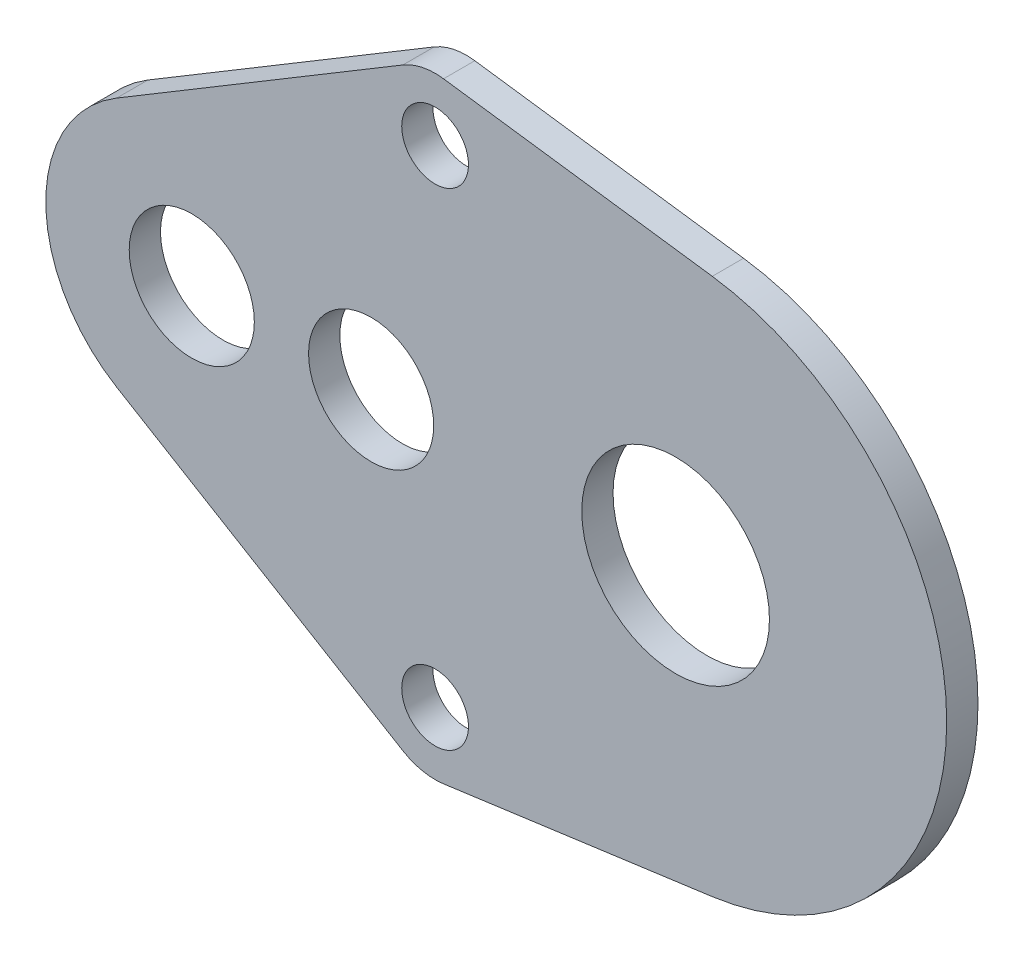
ISO-10303-21;
HEADER;
FILE_DESCRIPTION(('STEP AP214'),'2;1');
FILE_NAME('part.step','',(''),(''),'','','');
FILE_SCHEMA(('AUTOMOTIVE_DESIGN { 1 0 10303 214 1 1 1 1 }'));
ENDSEC;
DATA;
#1=APPLICATION_CONTEXT('core data for automotive mechanical design processes');
#2=APPLICATION_PROTOCOL_DEFINITION('international standard','automotive_design',2000,#1);
#3=PRODUCT_CONTEXT('',#1,'mechanical');
#4=PRODUCT('Part','Part','',(#3));
#5=PRODUCT_RELATED_PRODUCT_CATEGORY('part','',(#4));
#6=PRODUCT_DEFINITION_FORMATION('','',#4);
#7=PRODUCT_DEFINITION_CONTEXT('part definition',#1,'design');
#8=PRODUCT_DEFINITION('design','',#6,#7);
#9=PRODUCT_DEFINITION_SHAPE('','',#8);
#10=(LENGTH_UNIT() NAMED_UNIT(*) SI_UNIT(.MILLI.,.METRE.));
#11=(NAMED_UNIT(*) PLANE_ANGLE_UNIT() SI_UNIT($,.RADIAN.));
#12=(NAMED_UNIT(*) SI_UNIT($,.STERADIAN.) SOLID_ANGLE_UNIT());
#13=UNCERTAINTY_MEASURE_WITH_UNIT(LENGTH_MEASURE(1.E-05),#10,'distance_accuracy_value','');
#14=(GEOMETRIC_REPRESENTATION_CONTEXT(3) GLOBAL_UNCERTAINTY_ASSIGNED_CONTEXT((#13)) GLOBAL_UNIT_ASSIGNED_CONTEXT((#10,
#11,#12)) REPRESENTATION_CONTEXT('',''));
#15=CARTESIAN_POINT('',(0.,0.,0.));
#16=DIRECTION('',(0.,0.,1.));
#17=DIRECTION('',(1.,0.,0.));
#18=AXIS2_PLACEMENT_3D('',#15,#16,#17);
#19=CARTESIAN_POINT('',(11.667261889578,11.667261889578,1.6));
#20=DIRECTION('',(0.,0.,-1.));
#21=DIRECTION('',(-1.,0.,0.));
#22=AXIS2_PLACEMENT_3D('',#19,#20,#21);
#23=CYLINDRICAL_SURFACE('',#22,3.);
#24=DIRECTION('',(0.,0.,1.));
#25=VECTOR('',#24,1.);
#26=CARTESIAN_POINT('',(10.1234792899552,14.239563443654,-34.868952865985));
#27=LINE('',#26,#25);
#28=CARTESIAN_POINT('',(10.1234792899552,14.239563443654,1.6));
#29=VERTEX_POINT('',#28);
#30=CARTESIAN_POINT('',(10.1234792899552,14.239563443654,3.1));
#31=VERTEX_POINT('',#30);
#32=EDGE_CURVE('E55',#29,#31,#27,.T.);
#33=ORIENTED_EDGE('',*,*,#32,.T.);
#34=CARTESIAN_POINT('',(11.667261889578,11.667261889578,3.1));
#35=DIRECTION('',(0.,0.,1.));
#36=DIRECTION('',(1.,0.,0.));
#37=AXIS2_PLACEMENT_3D('',#34,#35,#36);
#38=CIRCLE('',#37,3.);
#39=CARTESIAN_POINT('',(12.0730700536144,14.6396884629355,3.1));
#40=VERTEX_POINT('',#39);
#41=EDGE_CURVE('E170',#40,#31,#38,.T.);
#42=ORIENTED_EDGE('',*,*,#41,.F.);
#43=DIRECTION('',(0.,0.,-1.));
#44=VECTOR('',#43,1.);
#45=CARTESIAN_POINT('',(12.0730700536144,14.6396884629355,1.6));
#46=LINE('',#45,#44);
#47=CARTESIAN_POINT('',(12.0730700536144,14.6396884629355,1.6));
#48=VERTEX_POINT('',#47);
#49=EDGE_CURVE('E181',#40,#48,#46,.T.);
#50=ORIENTED_EDGE('',*,*,#49,.T.);
#51=CARTESIAN_POINT('',(11.667261889578,11.667261889578,1.6));
#52=DIRECTION('',(0.,0.,1.));
#53=DIRECTION('',(1.,0.,0.));
#54=AXIS2_PLACEMENT_3D('',#51,#52,#53);
#55=CIRCLE('',#54,3.);
#56=EDGE_CURVE('E11',#48,#29,#55,.T.);
#57=ORIENTED_EDGE('',*,*,#56,.T.);
#58=EDGE_LOOP('',(#33,#42,#50,#57));
#59=FACE_BOUND('',#58,.T.);
#60=ADVANCED_FACE('F33',(#59),#23,.T.);
#61=CARTESIAN_POINT('',(11.667261889578,-11.667261889578,1.6));
#62=DIRECTION('',(0.,0.,-1.));
#63=DIRECTION('',(-1.,0.,0.));
#64=AXIS2_PLACEMENT_3D('',#61,#62,#63);
#65=CYLINDRICAL_SURFACE('',#64,3.);
#66=CARTESIAN_POINT('',(11.667261889578,-11.667261889578,3.1));
#67=DIRECTION('',(0.,0.,1.));
#68=DIRECTION('',(1.,0.,0.));
#69=AXIS2_PLACEMENT_3D('',#66,#67,#68);
#70=CIRCLE('',#69,3.);
#71=CARTESIAN_POINT('',(10.1234792899552,-14.239563443654,3.1));
#72=VERTEX_POINT('',#71);
#73=CARTESIAN_POINT('',(12.0730700536144,-14.6396884629355,3.1));
#74=VERTEX_POINT('',#73);
#75=EDGE_CURVE('E48',#72,#74,#70,.T.);
#76=ORIENTED_EDGE('',*,*,#75,.F.);
#77=DIRECTION('',(0.,0.,1.));
#78=VECTOR('',#77,1.);
#79=CARTESIAN_POINT('',(10.1234792899552,-14.239563443654,-34.868952865985));
#80=LINE('',#79,#78);
#81=CARTESIAN_POINT('',(10.1234792899552,-14.239563443654,1.6));
#82=VERTEX_POINT('',#81);
#83=EDGE_CURVE('E110',#82,#72,#80,.T.);
#84=ORIENTED_EDGE('',*,*,#83,.F.);
#85=CARTESIAN_POINT('',(11.667261889578,-11.667261889578,1.6));
#86=DIRECTION('',(0.,0.,1.));
#87=DIRECTION('',(1.,0.,0.));
#88=AXIS2_PLACEMENT_3D('',#85,#86,#87);
#89=CIRCLE('',#88,3.);
#90=CARTESIAN_POINT('',(12.0730700536144,-14.6396884629355,1.6));
#91=VERTEX_POINT('',#90);
#92=EDGE_CURVE('E169',#82,#91,#89,.T.);
#93=ORIENTED_EDGE('',*,*,#92,.T.);
#94=DIRECTION('',(0.,0.,-1.));
#95=VECTOR('',#94,1.);
#96=CARTESIAN_POINT('',(12.0730700536144,-14.6396884629355,1.6));
#97=LINE('',#96,#95);
#98=EDGE_CURVE('E36',#74,#91,#97,.T.);
#99=ORIENTED_EDGE('',*,*,#98,.F.);
#100=EDGE_LOOP('',(#76,#84,#93,#99));
#101=FACE_BOUND('',#100,.T.);
#102=ADVANCED_FACE('F198',(#101),#65,.T.);
#103=CARTESIAN_POINT('',(12.0730700536144,-14.6396884629355,1.6));
#104=DIRECTION('',(-0.135269388012114,0.990808857785813,0.));
#105=DIRECTION('',(-0.990808857785813,-0.135269388012114,0.));
#106=AXIS2_PLACEMENT_3D('',#103,#104,#105);
#107=PLANE('',#106);
#108=DIRECTION('',(-0.990808857785813,-0.135269388012114,0.));
#109=VECTOR('',#108,1.);
#110=CARTESIAN_POINT('',(12.0730700536144,-14.6396884629355,1.6));
#111=LINE('',#110,#109);
#112=CARTESIAN_POINT('',(24.9585020441575,-12.8805151512156,1.6));
#113=VERTEX_POINT('',#112);
#114=EDGE_CURVE('E131',#113,#91,#111,.T.);
#115=ORIENTED_EDGE('',*,*,#114,.F.);
#116=DIRECTION('',(0.,0.,-1.));
#117=VECTOR('',#116,1.);
#118=CARTESIAN_POINT('',(24.9585020441575,-12.8805151512156,1.6));
#119=LINE('',#118,#117);
#120=CARTESIAN_POINT('',(24.9585020441575,-12.8805151512156,3.1));
#121=VERTEX_POINT('',#120);
#122=EDGE_CURVE('E188',#121,#113,#119,.T.);
#123=ORIENTED_EDGE('',*,*,#122,.F.);
#124=DIRECTION('',(0.990808857785813,0.135269388012114,0.));
#125=VECTOR('',#124,1.);
#126=CARTESIAN_POINT('',(12.0730700536144,-14.6396884629355,3.1));
#127=LINE('',#126,#125);
#128=EDGE_CURVE('E173',#74,#121,#127,.T.);
#129=ORIENTED_EDGE('',*,*,#128,.F.);
#130=ORIENTED_EDGE('',*,*,#98,.T.);
#131=EDGE_LOOP('',(#115,#123,#129,#130));
#132=FACE_BOUND('',#131,.T.);
#133=ADVANCED_FACE('F197',(#132),#107,.F.);
#134=CARTESIAN_POINT('',(23.2,0.,1.6));
#135=DIRECTION('',(0.,0.,-1.));
#136=DIRECTION('',(-1.,0.,0.));
#137=AXIS2_PLACEMENT_3D('',#134,#135,#136);
#138=CYLINDRICAL_SURFACE('',#137,13.);
#139=CARTESIAN_POINT('',(23.2,0.,1.6));
#140=DIRECTION('',(0.,0.,-1.));
#141=DIRECTION('',(-1.,0.,0.));
#142=AXIS2_PLACEMENT_3D('',#139,#140,#141);
#143=CIRCLE('',#142,13.);
#144=CARTESIAN_POINT('',(24.9585020441575,12.8805151512156,1.6));
#145=VERTEX_POINT('',#144);
#146=EDGE_CURVE('E134',#145,#113,#143,.T.);
#147=ORIENTED_EDGE('',*,*,#146,.F.);
#148=DIRECTION('',(0.,0.,-1.));
#149=VECTOR('',#148,1.);
#150=CARTESIAN_POINT('',(24.9585020441575,12.8805151512156,1.6));
#151=LINE('',#150,#149);
#152=CARTESIAN_POINT('',(24.9585020441575,12.8805151512156,3.1));
#153=VERTEX_POINT('',#152);
#154=EDGE_CURVE('E186',#153,#145,#151,.T.);
#155=ORIENTED_EDGE('',*,*,#154,.F.);
#156=CARTESIAN_POINT('',(23.2,0.,3.1));
#157=DIRECTION('',(0.,0.,1.));
#158=DIRECTION('',(1.,0.,0.));
#159=AXIS2_PLACEMENT_3D('',#156,#157,#158);
#160=CIRCLE('',#159,13.);
#161=EDGE_CURVE('E176',#121,#153,#160,.T.);
#162=ORIENTED_EDGE('',*,*,#161,.F.);
#163=ORIENTED_EDGE('',*,*,#122,.T.);
#164=EDGE_LOOP('',(#147,#155,#162,#163));
#165=FACE_BOUND('',#164,.T.);
#166=ADVANCED_FACE('F200',(#165),#138,.T.);
#167=CARTESIAN_POINT('',(12.0730700536144,14.6396884629355,1.6));
#168=DIRECTION('',(-0.135269388012114,-0.990808857785813,0.));
#169=DIRECTION('',(0.990808857785813,-0.135269388012114,0.));
#170=AXIS2_PLACEMENT_3D('',#167,#168,#169);
#171=PLANE('',#170);
#172=DIRECTION('',(0.990808857785813,-0.135269388012114,0.));
#173=VECTOR('',#172,1.);
#174=CARTESIAN_POINT('',(12.0730700536144,14.6396884629355,1.6));
#175=LINE('',#174,#173);
#176=EDGE_CURVE('E137',#48,#145,#175,.T.);
#177=ORIENTED_EDGE('',*,*,#176,.F.);
#178=ORIENTED_EDGE('',*,*,#49,.F.);
#179=DIRECTION('',(-0.990808857785813,0.135269388012114,0.));
#180=VECTOR('',#179,1.);
#181=CARTESIAN_POINT('',(12.0730700536144,14.6396884629355,3.1));
#182=LINE('',#181,#180);
#183=EDGE_CURVE('E179',#153,#40,#182,.T.);
#184=ORIENTED_EDGE('',*,*,#183,.F.);
#185=ORIENTED_EDGE('',*,*,#154,.T.);
#186=EDGE_LOOP('',(#177,#178,#184,#185));
#187=FACE_BOUND('',#186,.T.);
#188=ADVANCED_FACE('F203',(#187),#171,.F.);
#189=CARTESIAN_POINT('',(0.,0.,1.6));
#190=DIRECTION('',(0.,0.,-1.));
#191=DIRECTION('',(-1.,0.,0.));
#192=AXIS2_PLACEMENT_3D('',#189,#190,#191);
#193=CYLINDRICAL_SURFACE('',#192,3.);
#194=CARTESIAN_POINT('',(0.,0.,3.1));
#195=DIRECTION('',(0.,0.,1.));
#196=DIRECTION('',(1.,0.,0.));
#197=AXIS2_PLACEMENT_3D('',#194,#195,#196);
#198=CIRCLE('',#197,3.);
#199=CARTESIAN_POINT('',(3.,0.,3.1));
#200=VERTEX_POINT('',#199);
#201=EDGE_CURVE('E163',#200,#200,#198,.T.);
#202=ORIENTED_EDGE('',*,*,#201,.T.);
#203=EDGE_LOOP('',(#202));
#204=FACE_BOUND('',#203,.T.);
#205=CARTESIAN_POINT('',(0.,0.,1.6));
#206=DIRECTION('',(0.,0.,-1.));
#207=DIRECTION('',(-1.,0.,0.));
#208=AXIS2_PLACEMENT_3D('',#205,#206,#207);
#209=CIRCLE('',#208,3.);
#210=CARTESIAN_POINT('',(-3.,0.,1.6));
#211=VERTEX_POINT('',#210);
#212=EDGE_CURVE('E151',#211,#211,#209,.T.);
#213=ORIENTED_EDGE('',*,*,#212,.T.);
#214=EDGE_LOOP('',(#213));
#215=FACE_BOUND('',#214,.T.);
#216=ADVANCED_FACE('F221',(#204,#215),#193,.F.);
#217=CARTESIAN_POINT('',(23.2,0.,1.6));
#218=DIRECTION('',(0.,0.,-1.));
#219=DIRECTION('',(-1.,0.,0.));
#220=AXIS2_PLACEMENT_3D('',#217,#218,#219);
#221=CYLINDRICAL_SURFACE('',#220,4.5);
#222=CARTESIAN_POINT('',(23.2,0.,3.1));
#223=DIRECTION('',(0.,0.,1.));
#224=DIRECTION('',(1.,0.,0.));
#225=AXIS2_PLACEMENT_3D('',#222,#223,#224);
#226=CIRCLE('',#225,4.5);
#227=CARTESIAN_POINT('',(27.7,0.,3.1));
#228=VERTEX_POINT('',#227);
#229=EDGE_CURVE('E157',#228,#228,#226,.T.);
#230=ORIENTED_EDGE('',*,*,#229,.T.);
#231=EDGE_LOOP('',(#230));
#232=FACE_BOUND('',#231,.T.);
#233=CARTESIAN_POINT('',(23.2,0.,1.6));
#234=DIRECTION('',(0.,0.,-1.));
#235=DIRECTION('',(-1.,0.,0.));
#236=AXIS2_PLACEMENT_3D('',#233,#234,#235);
#237=CIRCLE('',#236,4.5);
#238=CARTESIAN_POINT('',(18.7,0.,1.6));
#239=VERTEX_POINT('',#238);
#240=EDGE_CURVE('E148',#239,#239,#237,.T.);
#241=ORIENTED_EDGE('',*,*,#240,.T.);
#242=EDGE_LOOP('',(#241));
#243=FACE_BOUND('',#242,.T.);
#244=ADVANCED_FACE('F224',(#232,#243),#221,.F.);
#245=CARTESIAN_POINT('',(8.6,0.,1.6));
#246=DIRECTION('',(0.,0.,-1.));
#247=DIRECTION('',(-1.,0.,0.));
#248=AXIS2_PLACEMENT_3D('',#245,#246,#247);
#249=CYLINDRICAL_SURFACE('',#248,3.);
#250=CARTESIAN_POINT('',(8.6,0.,3.1));
#251=DIRECTION('',(0.,0.,1.));
#252=DIRECTION('',(1.,0.,0.));
#253=AXIS2_PLACEMENT_3D('',#250,#251,#252);
#254=CIRCLE('',#253,3.);
#255=CARTESIAN_POINT('',(11.6,0.,3.1));
#256=VERTEX_POINT('',#255);
#257=EDGE_CURVE('E160',#256,#256,#254,.T.);
#258=ORIENTED_EDGE('',*,*,#257,.T.);
#259=EDGE_LOOP('',(#258));
#260=FACE_BOUND('',#259,.T.);
#261=CARTESIAN_POINT('',(8.6,0.,1.6));
#262=DIRECTION('',(0.,0.,-1.));
#263=DIRECTION('',(-1.,0.,0.));
#264=AXIS2_PLACEMENT_3D('',#261,#262,#263);
#265=CIRCLE('',#264,3.);
#266=CARTESIAN_POINT('',(5.6,0.,1.6));
#267=VERTEX_POINT('',#266);
#268=EDGE_CURVE('E145',#267,#267,#265,.T.);
#269=ORIENTED_EDGE('',*,*,#268,.T.);
#270=EDGE_LOOP('',(#269));
#271=FACE_BOUND('',#270,.T.);
#272=ADVANCED_FACE('F228',(#260,#271),#249,.F.);
#273=CARTESIAN_POINT('',(11.667261889578,11.667261889578,1.6));
#274=DIRECTION('',(0.,0.,-1.));
#275=DIRECTION('',(-1.,0.,0.));
#276=AXIS2_PLACEMENT_3D('',#273,#274,#275);
#277=CYLINDRICAL_SURFACE('',#276,1.6);
#278=CARTESIAN_POINT('',(11.667261889578,11.667261889578,3.1));
#279=DIRECTION('',(0.,0.,1.));
#280=DIRECTION('',(1.,0.,0.));
#281=AXIS2_PLACEMENT_3D('',#278,#279,#280);
#282=CIRCLE('',#281,1.6);
#283=CARTESIAN_POINT('',(13.267261889578,11.667261889578,3.1));
#284=VERTEX_POINT('',#283);
#285=EDGE_CURVE('E166',#284,#284,#282,.T.);
#286=ORIENTED_EDGE('',*,*,#285,.T.);
#287=EDGE_LOOP('',(#286));
#288=FACE_BOUND('',#287,.T.);
#289=CARTESIAN_POINT('',(11.667261889578,11.667261889578,1.6));
#290=DIRECTION('',(0.,0.,-1.));
#291=DIRECTION('',(-1.,0.,0.));
#292=AXIS2_PLACEMENT_3D('',#289,#290,#291);
#293=CIRCLE('',#292,1.6);
#294=CARTESIAN_POINT('',(10.067261889578,11.667261889578,1.6));
#295=VERTEX_POINT('',#294);
#296=EDGE_CURVE('E142',#295,#295,#293,.T.);
#297=ORIENTED_EDGE('',*,*,#296,.T.);
#298=EDGE_LOOP('',(#297));
#299=FACE_BOUND('',#298,.T.);
#300=ADVANCED_FACE('F232',(#288,#299),#277,.F.);
#301=CARTESIAN_POINT('',(11.667261889578,-11.667261889578,1.6));
#302=DIRECTION('',(0.,0.,-1.));
#303=DIRECTION('',(-1.,0.,0.));
#304=AXIS2_PLACEMENT_3D('',#301,#302,#303);
#305=CYLINDRICAL_SURFACE('',#304,1.6);
#306=CARTESIAN_POINT('',(11.667261889578,-11.667261889578,3.1));
#307=DIRECTION('',(0.,0.,1.));
#308=DIRECTION('',(1.,0.,0.));
#309=AXIS2_PLACEMENT_3D('',#306,#307,#308);
#310=CIRCLE('',#309,1.6);
#311=CARTESIAN_POINT('',(13.267261889578,-11.667261889578,3.1));
#312=VERTEX_POINT('',#311);
#313=EDGE_CURVE('E154',#312,#312,#310,.T.);
#314=ORIENTED_EDGE('',*,*,#313,.T.);
#315=EDGE_LOOP('',(#314));
#316=FACE_BOUND('',#315,.T.);
#317=CARTESIAN_POINT('',(11.667261889578,-11.667261889578,1.6));
#318=DIRECTION('',(0.,0.,-1.));
#319=DIRECTION('',(-1.,0.,0.));
#320=AXIS2_PLACEMENT_3D('',#317,#318,#319);
#321=CIRCLE('',#320,1.6);
#322=CARTESIAN_POINT('',(10.067261889578,-11.667261889578,1.6));
#323=VERTEX_POINT('',#322);
#324=EDGE_CURVE('E139',#323,#323,#321,.T.);
#325=ORIENTED_EDGE('',*,*,#324,.T.);
#326=EDGE_LOOP('',(#325));
#327=FACE_BOUND('',#326,.T.);
#328=ADVANCED_FACE('F236',(#316,#327),#305,.F.);
#329=CARTESIAN_POINT('',(11.667261889578,11.667261889578,3.1));
#330=DIRECTION('',(0.,0.,1.));
#331=DIRECTION('',(1.,0.,0.));
#332=AXIS2_PLACEMENT_3D('',#329,#330,#331);
#333=PLANE('',#332);
#334=DIRECTION('',(0.857433851358664,-0.514594199874278,0.));
#335=VECTOR('',#334,1.);
#336=CARTESIAN_POINT('',(-3.60215939911994,-6.00203695951065,3.1));
#337=LINE('',#336,#335);
#338=CARTESIAN_POINT('',(-3.60215939911994,-6.00203695951065,3.1));
#339=VERTEX_POINT('',#338);
#340=EDGE_CURVE('E135',#339,#72,#337,.T.);
#341=ORIENTED_EDGE('',*,*,#340,.T.);
#342=ORIENTED_EDGE('',*,*,#75,.T.);
#343=ORIENTED_EDGE('',*,*,#128,.T.);
#344=ORIENTED_EDGE('',*,*,#161,.T.);
#345=ORIENTED_EDGE('',*,*,#183,.T.);
#346=ORIENTED_EDGE('',*,*,#41,.T.);
#347=DIRECTION('',(-0.857433851358664,-0.514594199874278,0.));
#348=VECTOR('',#347,1.);
#349=CARTESIAN_POINT('',(-3.60215939911994,6.00203695951065,3.1));
#350=LINE('',#349,#348);
#351=CARTESIAN_POINT('',(-3.60215939911994,6.00203695951065,3.1));
#352=VERTEX_POINT('',#351);
#353=EDGE_CURVE('E120',#31,#352,#350,.T.);
#354=ORIENTED_EDGE('',*,*,#353,.T.);
#355=CARTESIAN_POINT('',(0.,0.,3.1));
#356=DIRECTION('',(0.,0.,1.));
#357=DIRECTION('',(1.,0.,0.));
#358=AXIS2_PLACEMENT_3D('',#355,#356,#357);
#359=CIRCLE('',#358,7.);
#360=EDGE_CURVE('E116',#352,#339,#359,.T.);
#361=ORIENTED_EDGE('',*,*,#360,.T.);
#362=EDGE_LOOP('',(#341,#342,#343,#344,#345,#346,#354,#361));
#363=FACE_BOUND('',#362,.T.);
#364=ORIENTED_EDGE('',*,*,#229,.F.);
#365=EDGE_LOOP('',(#364));
#366=FACE_BOUND('',#365,.T.);
#367=ORIENTED_EDGE('',*,*,#313,.F.);
#368=EDGE_LOOP('',(#367));
#369=FACE_BOUND('',#368,.T.);
#370=ORIENTED_EDGE('',*,*,#257,.F.);
#371=EDGE_LOOP('',(#370));
#372=FACE_BOUND('',#371,.T.);
#373=ORIENTED_EDGE('',*,*,#285,.F.);
#374=EDGE_LOOP('',(#373));
#375=FACE_BOUND('',#374,.T.);
#376=ORIENTED_EDGE('',*,*,#201,.F.);
#377=EDGE_LOOP('',(#376));
#378=FACE_BOUND('',#377,.T.);
#379=ADVANCED_FACE('F206',(#363,#366,#369,#372,#375,#378),#333,.T.);
#380=CARTESIAN_POINT('',(0.,0.,1.6));
#381=DIRECTION('',(0.,0.,-1.));
#382=DIRECTION('',(-1.,0.,0.));
#383=AXIS2_PLACEMENT_3D('',#380,#381,#382);
#384=PLANE('',#383);
#385=ORIENTED_EDGE('',*,*,#92,.F.);
#386=DIRECTION('',(0.857433851358664,-0.514594199874278,0.));
#387=VECTOR('',#386,1.);
#388=CARTESIAN_POINT('',(-3.60215939911994,-6.00203695951065,1.6));
#389=LINE('',#388,#387);
#390=CARTESIAN_POINT('',(-3.60215939911994,-6.00203695951065,1.6));
#391=VERTEX_POINT('',#390);
#392=EDGE_CURVE('E106',#391,#82,#389,.T.);
#393=ORIENTED_EDGE('',*,*,#392,.F.);
#394=CARTESIAN_POINT('',(0.,0.,1.6));
#395=DIRECTION('',(0.,0.,-1.));
#396=DIRECTION('',(-1.,0.,0.));
#397=AXIS2_PLACEMENT_3D('',#394,#395,#396);
#398=CIRCLE('',#397,7.);
#399=CARTESIAN_POINT('',(-3.60215939911994,6.00203695951065,1.6));
#400=VERTEX_POINT('',#399);
#401=EDGE_CURVE('E98',#400,#391,#398,.F.);
#402=ORIENTED_EDGE('',*,*,#401,.F.);
#403=DIRECTION('',(-0.857433851358664,-0.514594199874278,0.));
#404=VECTOR('',#403,1.);
#405=CARTESIAN_POINT('',(-3.60215939911994,6.00203695951065,1.6));
#406=LINE('',#405,#404);
#407=EDGE_CURVE('E104',#29,#400,#406,.T.);
#408=ORIENTED_EDGE('',*,*,#407,.F.);
#409=ORIENTED_EDGE('',*,*,#56,.F.);
#410=ORIENTED_EDGE('',*,*,#176,.T.);
#411=ORIENTED_EDGE('',*,*,#146,.T.);
#412=ORIENTED_EDGE('',*,*,#114,.T.);
#413=EDGE_LOOP('',(#385,#393,#402,#408,#409,#410,#411,#412));
#414=FACE_BOUND('',#413,.T.);
#415=ORIENTED_EDGE('',*,*,#240,.F.);
#416=EDGE_LOOP('',(#415));
#417=FACE_BOUND('',#416,.T.);
#418=ORIENTED_EDGE('',*,*,#324,.F.);
#419=EDGE_LOOP('',(#418));
#420=FACE_BOUND('',#419,.T.);
#421=ORIENTED_EDGE('',*,*,#296,.F.);
#422=EDGE_LOOP('',(#421));
#423=FACE_BOUND('',#422,.T.);
#424=ORIENTED_EDGE('',*,*,#268,.F.);
#425=EDGE_LOOP('',(#424));
#426=FACE_BOUND('',#425,.T.);
#427=ORIENTED_EDGE('',*,*,#212,.F.);
#428=EDGE_LOOP('',(#427));
#429=FACE_BOUND('',#428,.T.);
#430=ADVANCED_FACE('F101',(#414,#417,#420,#423,#426,#429),#384,.T.);
#431=CARTESIAN_POINT('',(-3.60215939911994,-6.00203695951065,-34.868952865985));
#432=DIRECTION('',(-0.514594199874278,-0.857433851358664,0.));
#433=DIRECTION('',(0.857433851358664,-0.514594199874278,0.));
#434=AXIS2_PLACEMENT_3D('',#431,#432,#433);
#435=PLANE('',#434);
#436=DIRECTION('',(0.,0.,1.));
#437=VECTOR('',#436,1.);
#438=CARTESIAN_POINT('',(-3.60215939911994,-6.00203695951065,-34.868952865985));
#439=LINE('',#438,#437);
#440=EDGE_CURVE('E109',#391,#339,#439,.T.);
#441=ORIENTED_EDGE('',*,*,#440,.F.);
#442=ORIENTED_EDGE('',*,*,#392,.T.);
#443=ORIENTED_EDGE('',*,*,#83,.T.);
#444=ORIENTED_EDGE('',*,*,#340,.F.);
#445=EDGE_LOOP('',(#441,#442,#443,#444));
#446=FACE_BOUND('',#445,.T.);
#447=ADVANCED_FACE('F245',(#446),#435,.T.);
#448=CARTESIAN_POINT('',(0.,0.,-34.868952865985));
#449=DIRECTION('',(0.,0.,1.));
#450=DIRECTION('',(1.,0.,0.));
#451=AXIS2_PLACEMENT_3D('',#448,#449,#450);
#452=CYLINDRICAL_SURFACE('',#451,7.);
#453=DIRECTION('',(0.,0.,1.));
#454=VECTOR('',#453,1.);
#455=CARTESIAN_POINT('',(-3.60215939911994,6.00203695951065,-34.868952865985));
#456=LINE('',#455,#454);
#457=EDGE_CURVE('E113',#400,#352,#456,.T.);
#458=ORIENTED_EDGE('',*,*,#457,.F.);
#459=ORIENTED_EDGE('',*,*,#401,.T.);
#460=ORIENTED_EDGE('',*,*,#440,.T.);
#461=ORIENTED_EDGE('',*,*,#360,.F.);
#462=EDGE_LOOP('',(#458,#459,#460,#461));
#463=FACE_BOUND('',#462,.T.);
#464=ADVANCED_FACE('F114',(#463),#452,.T.);
#465=CARTESIAN_POINT('',(-3.60215939911994,6.00203695951065,-34.868952865985));
#466=DIRECTION('',(-0.514594199874278,0.857433851358664,0.));
#467=DIRECTION('',(-0.857433851358664,-0.514594199874278,0.));
#468=AXIS2_PLACEMENT_3D('',#465,#466,#467);
#469=PLANE('',#468);
#470=ORIENTED_EDGE('',*,*,#32,.F.);
#471=ORIENTED_EDGE('',*,*,#407,.T.);
#472=ORIENTED_EDGE('',*,*,#457,.T.);
#473=ORIENTED_EDGE('',*,*,#353,.F.);
#474=EDGE_LOOP('',(#470,#471,#472,#473));
#475=FACE_BOUND('',#474,.T.);
#476=ADVANCED_FACE('F122',(#475),#469,.T.);
#477=CLOSED_SHELL('',(#60,#102,#133,#166,#188,#216,#244,#272,#300,#328,#379,#430,#447,#464,#476));
#478=MANIFOLD_SOLID_BREP('B2',#477);
#479=ADVANCED_BREP_SHAPE_REPRESENTATION('',(#18,#478),#14);
#480=SHAPE_DEFINITION_REPRESENTATION(#9,#479);
ENDSEC;
END-ISO-10303-21;
